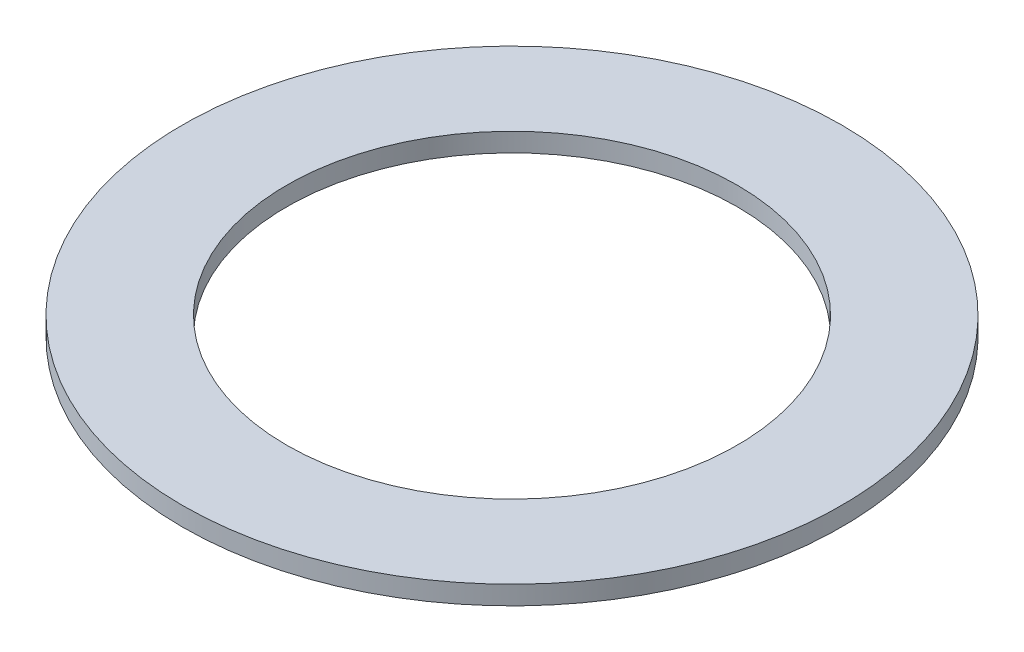
ISO-10303-21;
HEADER;
FILE_DESCRIPTION(('STEP AP214'),'2;1');
FILE_NAME('part.step','',(''),(''),'','','');
FILE_SCHEMA(('AUTOMOTIVE_DESIGN { 1 0 10303 214 1 1 1 1 }'));
ENDSEC;
DATA;
#1=APPLICATION_CONTEXT('core data for automotive mechanical design processes');
#2=APPLICATION_PROTOCOL_DEFINITION('international standard','automotive_design',2000,#1);
#3=PRODUCT_CONTEXT('',#1,'mechanical');
#4=PRODUCT('Part','Part','',(#3));
#5=PRODUCT_RELATED_PRODUCT_CATEGORY('part','',(#4));
#6=PRODUCT_DEFINITION_FORMATION('','',#4);
#7=PRODUCT_DEFINITION_CONTEXT('part definition',#1,'design');
#8=PRODUCT_DEFINITION('design','',#6,#7);
#9=PRODUCT_DEFINITION_SHAPE('','',#8);
#10=(LENGTH_UNIT() NAMED_UNIT(*) SI_UNIT(.MILLI.,.METRE.));
#11=(NAMED_UNIT(*) PLANE_ANGLE_UNIT() SI_UNIT($,.RADIAN.));
#12=(NAMED_UNIT(*) SI_UNIT($,.STERADIAN.) SOLID_ANGLE_UNIT());
#13=UNCERTAINTY_MEASURE_WITH_UNIT(LENGTH_MEASURE(1.E-05),#10,'distance_accuracy_value','');
#14=(GEOMETRIC_REPRESENTATION_CONTEXT(3) GLOBAL_UNCERTAINTY_ASSIGNED_CONTEXT((#13)) GLOBAL_UNIT_ASSIGNED_CONTEXT((#10,
#11,#12)) REPRESENTATION_CONTEXT('',''));
#15=CARTESIAN_POINT('',(0.,0.,0.));
#16=DIRECTION('',(0.,0.,1.));
#17=DIRECTION('',(1.,0.,0.));
#18=AXIS2_PLACEMENT_3D('',#15,#16,#17);
#19=CARTESIAN_POINT('',(0.,1.,0.));
#20=DIRECTION('',(0.,1.,0.));
#21=DIRECTION('',(0.,0.,1.));
#22=AXIS2_PLACEMENT_3D('',#19,#20,#21);
#23=PLANE('',#22);
#24=CARTESIAN_POINT('',(0.,1.,0.));
#25=DIRECTION('',(0.,1.,0.));
#26=DIRECTION('',(0.,0.,1.));
#27=AXIS2_PLACEMENT_3D('',#24,#25,#26);
#28=CIRCLE('',#27,17.5550963465074);
#29=CARTESIAN_POINT('',(0.,1.,17.5550963465074));
#30=VERTEX_POINT('',#29);
#31=EDGE_CURVE('E10',#30,#30,#28,.T.);
#32=ORIENTED_EDGE('',*,*,#31,.T.);
#33=EDGE_LOOP('',(#32));
#34=FACE_BOUND('',#33,.T.);
#35=CARTESIAN_POINT('',(0.,1.,0.));
#36=DIRECTION('',(0.,1.,0.));
#37=DIRECTION('',(0.,0.,1.));
#38=AXIS2_PLACEMENT_3D('',#35,#36,#37);
#39=CIRCLE('',#38,12.);
#40=CARTESIAN_POINT('',(0.,1.,12.));
#41=VERTEX_POINT('',#40);
#42=EDGE_CURVE('E46',#41,#41,#39,.T.);
#43=ORIENTED_EDGE('',*,*,#42,.F.);
#44=EDGE_LOOP('',(#43));
#45=FACE_BOUND('',#44,.T.);
#46=ADVANCED_FACE('F35',(#34,#45),#23,.T.);
#47=CARTESIAN_POINT('',(0.,0.,0.));
#48=DIRECTION('',(0.,1.,0.));
#49=DIRECTION('',(0.,0.,1.));
#50=AXIS2_PLACEMENT_3D('',#47,#48,#49);
#51=PLANE('',#50);
#52=CARTESIAN_POINT('',(0.,0.,0.));
#53=DIRECTION('',(0.,1.,0.));
#54=DIRECTION('',(0.,0.,1.));
#55=AXIS2_PLACEMENT_3D('',#52,#53,#54);
#56=CIRCLE('',#55,17.5550963465074);
#57=CARTESIAN_POINT('',(0.,0.,17.5550963465074));
#58=VERTEX_POINT('',#57);
#59=EDGE_CURVE('E39',#58,#58,#56,.T.);
#60=ORIENTED_EDGE('',*,*,#59,.F.);
#61=EDGE_LOOP('',(#60));
#62=FACE_BOUND('',#61,.T.);
#63=CARTESIAN_POINT('',(0.,0.,0.));
#64=DIRECTION('',(0.,1.,0.));
#65=DIRECTION('',(0.,0.,1.));
#66=AXIS2_PLACEMENT_3D('',#63,#64,#65);
#67=CIRCLE('',#66,12.);
#68=CARTESIAN_POINT('',(0.,0.,12.));
#69=VERTEX_POINT('',#68);
#70=EDGE_CURVE('E48',#69,#69,#67,.T.);
#71=ORIENTED_EDGE('',*,*,#70,.T.);
#72=EDGE_LOOP('',(#71));
#73=FACE_BOUND('',#72,.T.);
#74=ADVANCED_FACE('F58',(#62,#73),#51,.F.);
#75=CARTESIAN_POINT('',(0.,1.,0.));
#76=DIRECTION('',(0.,-1.,0.));
#77=DIRECTION('',(0.,0.,-1.));
#78=AXIS2_PLACEMENT_3D('',#75,#76,#77);
#79=CYLINDRICAL_SURFACE('',#78,17.5550963465074);
#80=ORIENTED_EDGE('',*,*,#31,.F.);
#81=EDGE_LOOP('',(#80));
#82=FACE_BOUND('',#81,.T.);
#83=ORIENTED_EDGE('',*,*,#59,.T.);
#84=EDGE_LOOP('',(#83));
#85=FACE_BOUND('',#84,.T.);
#86=ADVANCED_FACE('F37',(#82,#85),#79,.T.);
#87=CARTESIAN_POINT('',(0.,1.,0.));
#88=DIRECTION('',(0.,-1.,0.));
#89=DIRECTION('',(0.,0.,-1.));
#90=AXIS2_PLACEMENT_3D('',#87,#88,#89);
#91=CYLINDRICAL_SURFACE('',#90,12.);
#92=ORIENTED_EDGE('',*,*,#42,.T.);
#93=EDGE_LOOP('',(#92));
#94=FACE_BOUND('',#93,.T.);
#95=ORIENTED_EDGE('',*,*,#70,.F.);
#96=EDGE_LOOP('',(#95));
#97=FACE_BOUND('',#96,.T.);
#98=ADVANCED_FACE('F54',(#94,#97),#91,.F.);
#99=CLOSED_SHELL('',(#46,#74,#86,#98));
#100=MANIFOLD_SOLID_BREP('B2',#99);
#101=ADVANCED_BREP_SHAPE_REPRESENTATION('',(#18,#100),#14);
#102=SHAPE_DEFINITION_REPRESENTATION(#9,#101);
ENDSEC;
END-ISO-10303-21;
